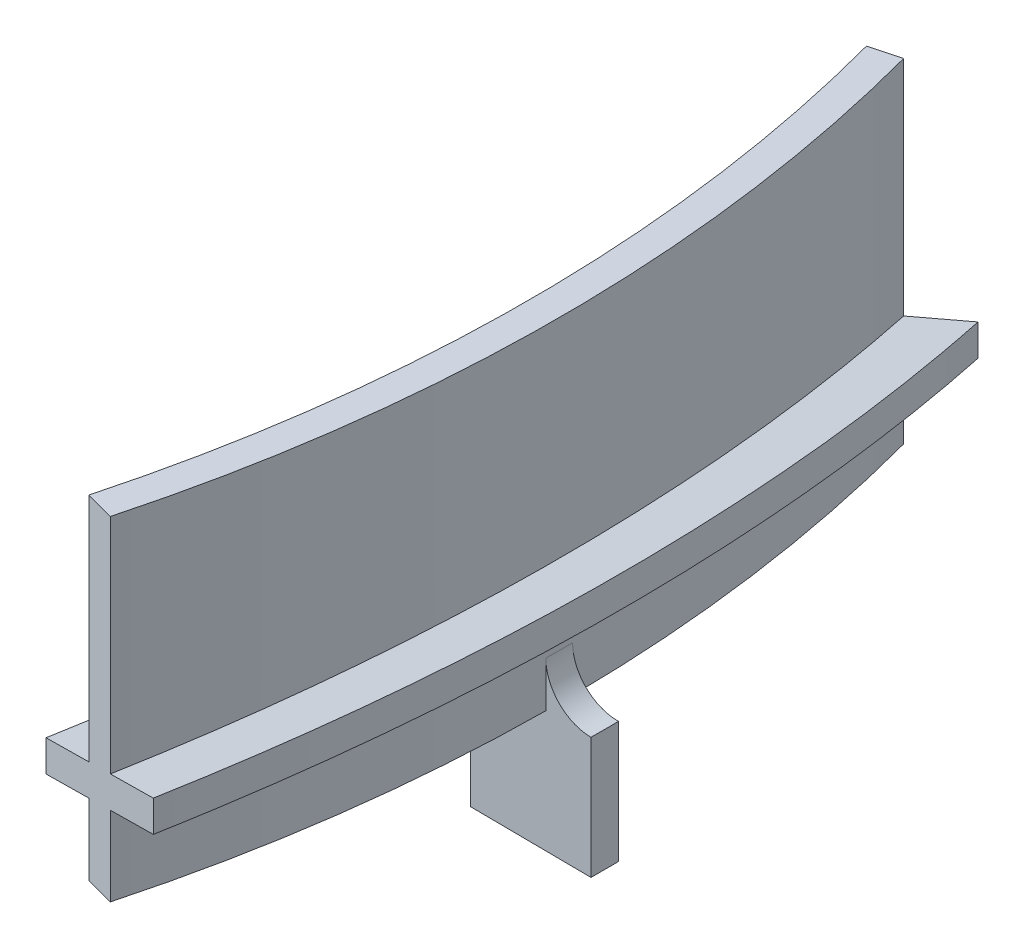
ISO-10303-21;
HEADER;
FILE_DESCRIPTION(('STEP AP214'),'2;1');
FILE_NAME('part.step','',(''),(''),'','','');
FILE_SCHEMA(('AUTOMOTIVE_DESIGN { 1 0 10303 214 1 1 1 1 }'));
ENDSEC;
DATA;
#1=APPLICATION_CONTEXT('core data for automotive mechanical design processes');
#2=APPLICATION_PROTOCOL_DEFINITION('international standard','automotive_design',2000,#1);
#3=PRODUCT_CONTEXT('',#1,'mechanical');
#4=PRODUCT('Part','Part','',(#3));
#5=PRODUCT_RELATED_PRODUCT_CATEGORY('part','',(#4));
#6=PRODUCT_DEFINITION_FORMATION('','',#4);
#7=PRODUCT_DEFINITION_CONTEXT('part definition',#1,'design');
#8=PRODUCT_DEFINITION('design','',#6,#7);
#9=PRODUCT_DEFINITION_SHAPE('','',#8);
#10=(LENGTH_UNIT() NAMED_UNIT(*) SI_UNIT(.MILLI.,.METRE.));
#11=(NAMED_UNIT(*) PLANE_ANGLE_UNIT() SI_UNIT($,.RADIAN.));
#12=(NAMED_UNIT(*) SI_UNIT($,.STERADIAN.) SOLID_ANGLE_UNIT());
#13=UNCERTAINTY_MEASURE_WITH_UNIT(LENGTH_MEASURE(1.E-05),#10,'distance_accuracy_value','');
#14=(GEOMETRIC_REPRESENTATION_CONTEXT(3) GLOBAL_UNCERTAINTY_ASSIGNED_CONTEXT((#13)) GLOBAL_UNIT_ASSIGNED_CONTEXT((#10,
#11,#12)) REPRESENTATION_CONTEXT('',''));
#15=CARTESIAN_POINT('',(0.,0.,0.));
#16=DIRECTION('',(0.,0.,1.));
#17=DIRECTION('',(1.,0.,0.));
#18=AXIS2_PLACEMENT_3D('',#15,#16,#17);
#19=CARTESIAN_POINT('',(97.5585084551959,-5.99999999999999,26.1407235553546));
#20=DIRECTION('',(0.,1.,0.));
#21=DIRECTION('',(0.,0.,1.));
#22=AXIS2_PLACEMENT_3D('',#19,#20,#21);
#23=PLANE('',#22);
#24=DIRECTION('',(-0.999961923064171,0.,-0.00872653549837396));
#25=VECTOR('',#24,1.);
#26=CARTESIAN_POINT('',(95.9963446141604,-5.99999999999998,0.837747407843899));
#27=LINE('',#26,#25);
#28=CARTESIAN_POINT('',(100.996154229481,-5.99999999999998,0.881380085335769));
#29=VERTEX_POINT('',#28);
#30=CARTESIAN_POINT('',(98.996230383353,-5.99999999999998,0.863927014339021));
#31=VERTEX_POINT('',#30);
#32=EDGE_CURVE('E202',#29,#31,#27,.T.);
#33=ORIENTED_EDGE('',*,*,#32,.F.);
#34=CARTESIAN_POINT('',(0.,-5.99999999999998,0.));
#35=DIRECTION('',(0.,1.,0.));
#36=DIRECTION('',(0.,0.,1.));
#37=AXIS2_PLACEMENT_3D('',#34,#35,#36);
#38=CIRCLE('',#37,101.);
#39=CARTESIAN_POINT('',(97.5585084551959,-5.99999999999999,26.1407235553546));
#40=VERTEX_POINT('',#39);
#41=EDGE_CURVE('E288',#40,#29,#38,.T.);
#42=ORIENTED_EDGE('',*,*,#41,.F.);
#43=DIRECTION('',(0.965925826289068,0.,0.258819045102521));
#44=VECTOR('',#43,1.);
#45=CARTESIAN_POINT('',(97.5585084551959,-5.99999999999999,26.1407235553546));
#46=LINE('',#45,#44);
#47=CARTESIAN_POINT('',(95.6266568026177,-5.99999999999999,25.6230854651496));
#48=VERTEX_POINT('',#47);
#49=EDGE_CURVE('E275',#48,#40,#46,.T.);
#50=ORIENTED_EDGE('',*,*,#49,.F.);
#51=CARTESIAN_POINT('',(0.,-5.99999999999998,0.));
#52=DIRECTION('',(0.,1.,0.));
#53=DIRECTION('',(0.,0.,1.));
#54=AXIS2_PLACEMENT_3D('',#51,#52,#53);
#55=CIRCLE('',#54,99.);
#56=EDGE_CURVE('E284',#48,#31,#55,.T.);
#57=ORIENTED_EDGE('',*,*,#56,.T.);
#58=EDGE_LOOP('',(#33,#42,#50,#57));
#59=FACE_BOUND('',#58,.T.);
#60=ADVANCED_FACE('F33',(#59),#23,.F.);
#61=CARTESIAN_POINT('',(0.,0.,0.));
#62=DIRECTION('',(0.258819045102521,0.,-0.965925826289068));
#63=DIRECTION('',(-0.965925826289068,0.,-0.258819045102521));
#64=AXIS2_PLACEMENT_3D('',#61,#62,#63);
#65=PLANE('',#64);
#66=DIRECTION('',(-0.933012701892218,-0.258819045102525,-0.25));
#67=VECTOR('',#66,1.);
#68=CARTESIAN_POINT('',(77.9323285910625,-4.14110472164041,20.8819045102521));
#69=LINE('',#68,#67);
#70=CARTESIAN_POINT('',(95.6266568026177,0.767326987978946,25.6230854651496));
#71=VERTEX_POINT('',#70);
#72=CARTESIAN_POINT('',(91.7629534974615,-0.304469781745555,24.5878092847395));
#73=VERTEX_POINT('',#72);
#74=EDGE_CURVE('E237',#71,#73,#69,.T.);
#75=ORIENTED_EDGE('',*,*,#74,.T.);
#76=DIRECTION('',(0.,1.,0.));
#77=VECTOR('',#76,1.);
#78=CARTESIAN_POINT('',(91.7629534974615,-6.21165708246058,24.5878092847395));
#79=LINE('',#78,#77);
#80=CARTESIAN_POINT('',(91.7629534974615,-2.37502214256572,24.5878092847395));
#81=VERTEX_POINT('',#80);
#82=EDGE_CURVE('E216',#81,#73,#79,.T.);
#83=ORIENTED_EDGE('',*,*,#82,.F.);
#84=DIRECTION('',(0.933012701892218,0.258819045102525,0.25));
#85=VECTOR('',#84,1.);
#86=CARTESIAN_POINT('',(115.252836666751,4.14110472164041,30.8819045102521));
#87=LINE('',#86,#85);
#88=CARTESIAN_POINT('',(95.6266568026177,-1.30322537284122,25.6230854651496));
#89=VERTEX_POINT('',#88);
#90=EDGE_CURVE('E235',#81,#89,#87,.T.);
#91=ORIENTED_EDGE('',*,*,#90,.T.);
#92=DIRECTION('',(0.,-1.,0.));
#93=VECTOR('',#92,1.);
#94=CARTESIAN_POINT('',(95.6266568026177,16.,25.6230854651496));
#95=LINE('',#94,#93);
#96=EDGE_CURVE('E271',#89,#48,#95,.T.);
#97=ORIENTED_EDGE('',*,*,#96,.T.);
#98=ORIENTED_EDGE('',*,*,#49,.T.);
#99=DIRECTION('',(0.,1.,0.));
#100=VECTOR('',#99,1.);
#101=CARTESIAN_POINT('',(97.5585084551959,16.,26.1407235553546));
#102=LINE('',#101,#100);
#103=CARTESIAN_POINT('',(97.5585084551959,-0.767326987978966,26.1407235553546));
#104=VERTEX_POINT('',#103);
#105=EDGE_CURVE('E265',#40,#104,#102,.T.);
#106=ORIENTED_EDGE('',*,*,#105,.T.);
#107=CARTESIAN_POINT('',(101.422211760352,0.304469781745548,27.1759997357647));
#108=VERTEX_POINT('',#107);
#109=EDGE_CURVE('E234',#104,#108,#87,.T.);
#110=ORIENTED_EDGE('',*,*,#109,.T.);
#111=DIRECTION('',(0.,1.,0.));
#112=VECTOR('',#111,1.);
#113=CARTESIAN_POINT('',(101.422211760352,-6.21165708246058,27.1759997357647));
#114=LINE('',#113,#112);
#115=CARTESIAN_POINT('',(101.422211760352,2.37502214256572,27.1759997357647));
#116=VERTEX_POINT('',#115);
#117=EDGE_CURVE('E219',#108,#116,#114,.T.);
#118=ORIENTED_EDGE('',*,*,#117,.T.);
#119=CARTESIAN_POINT('',(97.5585084551959,1.3032253728412,26.1407235553546));
#120=VERTEX_POINT('',#119);
#121=EDGE_CURVE('E238',#116,#120,#69,.T.);
#122=ORIENTED_EDGE('',*,*,#121,.T.);
#123=CARTESIAN_POINT('',(97.5585084551959,16.,26.1407235553546));
#124=VERTEX_POINT('',#123);
#125=EDGE_CURVE('E264',#120,#124,#102,.T.);
#126=ORIENTED_EDGE('',*,*,#125,.T.);
#127=DIRECTION('',(-0.965925826289068,0.,-0.258819045102521));
#128=VECTOR('',#127,1.);
#129=CARTESIAN_POINT('',(97.5585084551959,16.,26.1407235553546));
#130=LINE('',#129,#128);
#131=CARTESIAN_POINT('',(95.6266568026177,16.,25.6230854651496));
#132=VERTEX_POINT('',#131);
#133=EDGE_CURVE('E268',#124,#132,#130,.T.);
#134=ORIENTED_EDGE('',*,*,#133,.T.);
#135=EDGE_CURVE('E272',#132,#71,#95,.T.);
#136=ORIENTED_EDGE('',*,*,#135,.T.);
#137=EDGE_LOOP('',(#75,#83,#91,#97,#98,#106,#110,#118,#122,#126,#134,#136));
#138=FACE_BOUND('',#137,.T.);
#139=ADVANCED_FACE('F340',(#138),#65,.F.);
#140=CARTESIAN_POINT('',(77.9323285910625,-4.14110472164041,-36.1180954897479));
#141=DIRECTION('',(-0.267307160363569,0.963611374994279,0.));
#142=DIRECTION('',(-0.963611374994279,-0.267307160363569,0.));
#143=AXIS2_PLACEMENT_3D('',#140,#141,#142);
#144=PLANE('',#143);
#145=ORIENTED_EDGE('',*,*,#121,.F.);
#146=CARTESIAN_POINT('',(0.,-25.7596430627026,0.));
#147=DIRECTION('',(-0.267307160363569,0.963611374994279,0.));
#148=DIRECTION('',(0.963611374994279,0.267307160363569,0.));
#149=AXIS2_PLACEMENT_3D('',#146,#147,#148);
#150=ELLIPSE('',#149,108.965089791124,105.);
#151=CARTESIAN_POINT('',(101.422211760352,2.37502214256572,-27.1759997357647));
#152=VERTEX_POINT('',#151);
#153=EDGE_CURVE('E229',#116,#152,#150,.T.);
#154=ORIENTED_EDGE('',*,*,#153,.T.);
#155=DIRECTION('',(0.933012701892218,0.258819045102525,-0.25));
#156=VECTOR('',#155,1.);
#157=CARTESIAN_POINT('',(81.4862185191438,-3.15525062156221,-21.8341664464706));
#158=LINE('',#157,#156);
#159=CARTESIAN_POINT('',(97.5585084551959,1.30322537284121,-26.1407235553546));
#160=VERTEX_POINT('',#159);
#161=EDGE_CURVE('E218',#160,#152,#158,.T.);
#162=ORIENTED_EDGE('',*,*,#161,.F.);
#163=CARTESIAN_POINT('',(0.,-25.7596430627026,0.));
#164=DIRECTION('',(-0.267307160363569,0.963611374994279,0.));
#165=DIRECTION('',(0.963611374994279,0.267307160363569,0.));
#166=AXIS2_PLACEMENT_3D('',#163,#164,#165);
#167=ELLIPSE('',#166,104.814038751462,101.);
#168=EDGE_CURVE('E247',#120,#160,#167,.T.);
#169=ORIENTED_EDGE('',*,*,#168,.F.);
#170=EDGE_LOOP('',(#145,#154,#162,#169));
#171=FACE_BOUND('',#170,.T.);
#172=ADVANCED_FACE('F345',(#171),#144,.T.);
#173=CARTESIAN_POINT('',(115.252836666751,4.14110472164041,-26.1180954897479));
#174=DIRECTION('',(0.267307160363569,-0.963611374994279,0.));
#175=DIRECTION('',(0.963611374994279,0.267307160363569,0.));
#176=AXIS2_PLACEMENT_3D('',#173,#174,#175);
#177=PLANE('',#176);
#178=DIRECTION('',(-0.933012701892218,-0.258819045102525,0.25));
#179=VECTOR('',#178,1.);
#180=CARTESIAN_POINT('',(114.141663085371,3.83286359620598,-30.5841664464706));
#181=LINE('',#180,#179);
#182=CARTESIAN_POINT('',(101.422211760352,0.304469781745549,-27.1759997357647));
#183=VERTEX_POINT('',#182);
#184=CARTESIAN_POINT('',(97.5585084551959,-0.767326987978964,-26.1407235553546));
#185=VERTEX_POINT('',#184);
#186=EDGE_CURVE('E293',#183,#185,#181,.T.);
#187=ORIENTED_EDGE('',*,*,#186,.F.);
#188=CARTESIAN_POINT('',(0.,-27.8301954235228,0.));
#189=DIRECTION('',(0.267307160363569,-0.963611374994279,0.));
#190=DIRECTION('',(0.963611374994279,0.267307160363569,0.));
#191=AXIS2_PLACEMENT_3D('',#188,#189,#190);
#192=ELLIPSE('',#191,108.965089791124,105.);
#193=EDGE_CURVE('E203',#183,#108,#192,.T.);
#194=ORIENTED_EDGE('',*,*,#193,.T.);
#195=ORIENTED_EDGE('',*,*,#109,.F.);
#196=CARTESIAN_POINT('',(0.,-27.8301954235228,0.));
#197=DIRECTION('',(0.267307160363569,-0.963611374994279,0.));
#198=DIRECTION('',(0.963611374994279,0.267307160363569,0.));
#199=AXIS2_PLACEMENT_3D('',#196,#197,#198);
#200=ELLIPSE('',#199,104.814038751462,101.);
#201=EDGE_CURVE('E243',#185,#104,#200,.T.);
#202=ORIENTED_EDGE('',*,*,#201,.F.);
#203=EDGE_LOOP('',(#187,#194,#195,#202));
#204=FACE_BOUND('',#203,.T.);
#205=ADVANCED_FACE('F367',(#204),#177,.T.);
#206=CARTESIAN_POINT('',(0.,12.85,0.));
#207=DIRECTION('',(0.,1.,0.));
#208=DIRECTION('',(0.,0.,1.));
#209=AXIS2_PLACEMENT_3D('',#206,#207,#208);
#210=CYLINDRICAL_SURFACE('',#209,101.);
#211=ORIENTED_EDGE('',*,*,#125,.F.);
#212=ORIENTED_EDGE('',*,*,#168,.T.);
#213=DIRECTION('',(0.,1.,0.));
#214=VECTOR('',#213,1.);
#215=CARTESIAN_POINT('',(97.5585084551959,16.,-26.1407235553547));
#216=LINE('',#215,#214);
#217=CARTESIAN_POINT('',(97.5585084551959,16.,-26.1407235553547));
#218=VERTEX_POINT('',#217);
#219=EDGE_CURVE('E250',#160,#218,#216,.T.);
#220=ORIENTED_EDGE('',*,*,#219,.T.);
#221=CARTESIAN_POINT('',(0.,16.,0.));
#222=DIRECTION('',(0.,1.,0.));
#223=DIRECTION('',(0.,0.,1.));
#224=AXIS2_PLACEMENT_3D('',#221,#222,#223);
#225=CIRCLE('',#224,101.);
#226=EDGE_CURVE('E278',#124,#218,#225,.T.);
#227=ORIENTED_EDGE('',*,*,#226,.F.);
#228=EDGE_LOOP('',(#211,#212,#220,#227));
#229=FACE_BOUND('',#228,.T.);
#230=ADVANCED_FACE('F358',(#229),#210,.T.);
#231=CARTESIAN_POINT('',(0.,12.85,0.));
#232=DIRECTION('',(0.,1.,0.));
#233=DIRECTION('',(0.,0.,1.));
#234=AXIS2_PLACEMENT_3D('',#231,#232,#233);
#235=CYLINDRICAL_SURFACE('',#234,99.);
#236=DIRECTION('',(0.,-1.,0.));
#237=VECTOR('',#236,1.);
#238=CARTESIAN_POINT('',(95.6266568026177,16.,-25.6230854651496));
#239=LINE('',#238,#237);
#240=CARTESIAN_POINT('',(95.6266568026177,16.,-25.6230854651496));
#241=VERTEX_POINT('',#240);
#242=CARTESIAN_POINT('',(95.6266568026177,0.767326987978951,-25.6230854651496));
#243=VERTEX_POINT('',#242);
#244=EDGE_CURVE('E258',#241,#243,#239,.T.);
#245=ORIENTED_EDGE('',*,*,#244,.T.);
#246=CARTESIAN_POINT('',(0.,-25.7596430627026,0.));
#247=DIRECTION('',(-0.267307160363569,0.963611374994279,0.));
#248=DIRECTION('',(0.963611374994279,0.267307160363569,0.));
#249=AXIS2_PLACEMENT_3D('',#246,#247,#248);
#250=ELLIPSE('',#249,102.738513231631,99.);
#251=EDGE_CURVE('E245',#243,#71,#250,.F.);
#252=ORIENTED_EDGE('',*,*,#251,.T.);
#253=ORIENTED_EDGE('',*,*,#135,.F.);
#254=CARTESIAN_POINT('',(0.,16.,0.));
#255=DIRECTION('',(0.,1.,0.));
#256=DIRECTION('',(0.,0.,1.));
#257=AXIS2_PLACEMENT_3D('',#254,#255,#256);
#258=CIRCLE('',#257,99.);
#259=EDGE_CURVE('E281',#132,#241,#258,.T.);
#260=ORIENTED_EDGE('',*,*,#259,.T.);
#261=EDGE_LOOP('',(#245,#252,#253,#260));
#262=FACE_BOUND('',#261,.T.);
#263=ADVANCED_FACE('F356',(#262),#235,.F.);
#264=CARTESIAN_POINT('',(0.,-2.99999999999999,0.));
#265=DIRECTION('',(0.,-1.,0.));
#266=DIRECTION('',(0.,0.,-1.));
#267=AXIS2_PLACEMENT_3D('',#264,#265,#266);
#268=CIRCLE('',#267,101.);
#269=CARTESIAN_POINT('',(100.996154229481,-2.99999999999999,0.88138008533577));
#270=VERTEX_POINT('',#269);
#271=CARTESIAN_POINT('',(100.996154229481,-2.99999999999999,-0.881380085335769));
#272=VERTEX_POINT('',#271);
#273=EDGE_CURVE('E303',#270,#272,#268,.F.);
#274=ORIENTED_EDGE('',*,*,#273,.T.);
#275=DIRECTION('',(0.,1.,0.));
#276=VECTOR('',#275,1.);
#277=CARTESIAN_POINT('',(100.996154229481,-2.99999999999999,-0.881380085335769));
#278=LINE('',#277,#276);
#279=CARTESIAN_POINT('',(100.996154229481,-5.99999999999998,-0.88138008533577));
#280=VERTEX_POINT('',#279);
#281=EDGE_CURVE('E306',#272,#280,#278,.F.);
#282=ORIENTED_EDGE('',*,*,#281,.T.);
#283=CARTESIAN_POINT('',(97.5585084551959,-5.99999999999999,-26.1407235553547));
#284=VERTEX_POINT('',#283);
#285=EDGE_CURVE('E287',#280,#284,#38,.T.);
#286=ORIENTED_EDGE('',*,*,#285,.T.);
#287=EDGE_CURVE('E251',#284,#185,#216,.T.);
#288=ORIENTED_EDGE('',*,*,#287,.T.);
#289=ORIENTED_EDGE('',*,*,#201,.T.);
#290=ORIENTED_EDGE('',*,*,#105,.F.);
#291=ORIENTED_EDGE('',*,*,#41,.T.);
#292=DIRECTION('',(0.,1.,0.));
#293=VECTOR('',#292,1.);
#294=CARTESIAN_POINT('',(100.996154229481,-5.99999999999998,0.881380085335769));
#295=LINE('',#294,#293);
#296=EDGE_CURVE('E47',#29,#270,#295,.T.);
#297=ORIENTED_EDGE('',*,*,#296,.T.);
#298=EDGE_LOOP('',(#274,#282,#286,#288,#289,#290,#291,#297));
#299=FACE_BOUND('',#298,.T.);
#300=ADVANCED_FACE('F320',(#299),#210,.T.);
#301=ORIENTED_EDGE('',*,*,#285,.F.);
#302=DIRECTION('',(-0.999961923064171,0.,0.00872653549837395));
#303=VECTOR('',#302,1.);
#304=CARTESIAN_POINT('',(95.9963446141604,-5.99999999999998,-0.8377474078439));
#305=LINE('',#304,#303);
#306=CARTESIAN_POINT('',(98.996230383353,-5.99999999999998,-0.863927014339021));
#307=VERTEX_POINT('',#306);
#308=EDGE_CURVE('E199',#280,#307,#305,.T.);
#309=ORIENTED_EDGE('',*,*,#308,.T.);
#310=CARTESIAN_POINT('',(95.6266568026177,-5.99999999999999,-25.6230854651496));
#311=VERTEX_POINT('',#310);
#312=EDGE_CURVE('E283',#307,#311,#55,.T.);
#313=ORIENTED_EDGE('',*,*,#312,.T.);
#314=DIRECTION('',(0.965925826289068,0.,-0.258819045102521));
#315=VECTOR('',#314,1.);
#316=CARTESIAN_POINT('',(97.5585084551959,-5.99999999999999,-26.1407235553547));
#317=LINE('',#316,#315);
#318=EDGE_CURVE('E261',#311,#284,#317,.T.);
#319=ORIENTED_EDGE('',*,*,#318,.T.);
#320=EDGE_LOOP('',(#301,#309,#313,#319));
#321=FACE_BOUND('',#320,.T.);
#322=ADVANCED_FACE('F341',(#321),#23,.F.);
#323=ORIENTED_EDGE('',*,*,#312,.F.);
#324=DIRECTION('',(0.,1.,0.));
#325=VECTOR('',#324,1.);
#326=CARTESIAN_POINT('',(98.996230383353,-5.99999999999998,-0.863927014339021));
#327=LINE('',#326,#325);
#328=CARTESIAN_POINT('',(98.996230383353,-2.99999999999999,-0.863927014339021));
#329=VERTEX_POINT('',#328);
#330=EDGE_CURVE('E55',#307,#329,#327,.T.);
#331=ORIENTED_EDGE('',*,*,#330,.T.);
#332=CARTESIAN_POINT('',(0.,-2.99999999999999,0.));
#333=DIRECTION('',(0.,-1.,0.));
#334=DIRECTION('',(0.,0.,-1.));
#335=AXIS2_PLACEMENT_3D('',#332,#333,#334);
#336=CIRCLE('',#335,99.);
#337=CARTESIAN_POINT('',(98.996230383353,-2.99999999999999,0.863927014339022));
#338=VERTEX_POINT('',#337);
#339=EDGE_CURVE('E298',#329,#338,#336,.T.);
#340=ORIENTED_EDGE('',*,*,#339,.T.);
#341=DIRECTION('',(0.,1.,0.));
#342=VECTOR('',#341,1.);
#343=CARTESIAN_POINT('',(98.996230383353,-2.99999999999999,0.863927014339022));
#344=LINE('',#343,#342);
#345=EDGE_CURVE('E210',#338,#31,#344,.F.);
#346=ORIENTED_EDGE('',*,*,#345,.T.);
#347=ORIENTED_EDGE('',*,*,#56,.F.);
#348=ORIENTED_EDGE('',*,*,#96,.F.);
#349=CARTESIAN_POINT('',(0.,-27.8301954235228,0.));
#350=DIRECTION('',(0.267307160363569,-0.963611374994279,0.));
#351=DIRECTION('',(0.963611374994279,0.267307160363569,0.));
#352=AXIS2_PLACEMENT_3D('',#349,#350,#351);
#353=ELLIPSE('',#352,102.738513231631,99.);
#354=CARTESIAN_POINT('',(95.6266568026177,-1.30322537284121,-25.6230854651496));
#355=VERTEX_POINT('',#354);
#356=EDGE_CURVE('E240',#89,#355,#353,.F.);
#357=ORIENTED_EDGE('',*,*,#356,.T.);
#358=EDGE_CURVE('E257',#355,#311,#239,.T.);
#359=ORIENTED_EDGE('',*,*,#358,.T.);
#360=EDGE_LOOP('',(#323,#331,#340,#346,#347,#348,#357,#359));
#361=FACE_BOUND('',#360,.T.);
#362=ADVANCED_FACE('F329',(#361),#235,.F.);
#363=CARTESIAN_POINT('',(97.5585084551959,16.,26.1407235553546));
#364=DIRECTION('',(0.,-1.,0.));
#365=DIRECTION('',(0.,0.,-1.));
#366=AXIS2_PLACEMENT_3D('',#363,#364,#365);
#367=PLANE('',#366);
#368=ORIENTED_EDGE('',*,*,#133,.F.);
#369=ORIENTED_EDGE('',*,*,#226,.T.);
#370=DIRECTION('',(-0.965925826289068,0.,0.258819045102521));
#371=VECTOR('',#370,1.);
#372=CARTESIAN_POINT('',(97.5585084551959,16.,-26.1407235553547));
#373=LINE('',#372,#371);
#374=EDGE_CURVE('E254',#218,#241,#373,.T.);
#375=ORIENTED_EDGE('',*,*,#374,.T.);
#376=ORIENTED_EDGE('',*,*,#259,.F.);
#377=EDGE_LOOP('',(#368,#369,#375,#376));
#378=FACE_BOUND('',#377,.T.);
#379=ADVANCED_FACE('F355',(#378),#367,.F.);
#380=CARTESIAN_POINT('',(0.,0.,0.));
#381=DIRECTION('',(-0.258819045102521,0.,-0.965925826289068));
#382=DIRECTION('',(-0.965925826289068,0.,0.258819045102521));
#383=AXIS2_PLACEMENT_3D('',#380,#381,#382);
#384=PLANE('',#383);
#385=ORIENTED_EDGE('',*,*,#358,.F.);
#386=CARTESIAN_POINT('',(91.7629534974615,-2.37502214256572,-24.5878092847395));
#387=VERTEX_POINT('',#386);
#388=EDGE_CURVE('E290',#355,#387,#181,.T.);
#389=ORIENTED_EDGE('',*,*,#388,.T.);
#390=DIRECTION('',(0.,1.,0.));
#391=VECTOR('',#390,1.);
#392=CARTESIAN_POINT('',(91.7629534974615,-6.21165708246058,-24.5878092847395));
#393=LINE('',#392,#391);
#394=CARTESIAN_POINT('',(91.7629534974615,-0.304469781745554,-24.5878092847395));
#395=VERTEX_POINT('',#394);
#396=EDGE_CURVE('E182',#387,#395,#393,.T.);
#397=ORIENTED_EDGE('',*,*,#396,.T.);
#398=EDGE_CURVE('E228',#395,#243,#158,.T.);
#399=ORIENTED_EDGE('',*,*,#398,.T.);
#400=ORIENTED_EDGE('',*,*,#244,.F.);
#401=ORIENTED_EDGE('',*,*,#374,.F.);
#402=ORIENTED_EDGE('',*,*,#219,.F.);
#403=ORIENTED_EDGE('',*,*,#161,.T.);
#404=DIRECTION('',(0.,1.,0.));
#405=VECTOR('',#404,1.);
#406=CARTESIAN_POINT('',(101.422211760352,-6.21165708246058,-27.1759997357647));
#407=LINE('',#406,#405);
#408=EDGE_CURVE('E222',#183,#152,#407,.T.);
#409=ORIENTED_EDGE('',*,*,#408,.F.);
#410=ORIENTED_EDGE('',*,*,#186,.T.);
#411=ORIENTED_EDGE('',*,*,#287,.F.);
#412=ORIENTED_EDGE('',*,*,#318,.F.);
#413=EDGE_LOOP('',(#385,#389,#397,#399,#400,#401,#402,#403,#409,#410,#411,#412));
#414=FACE_BOUND('',#413,.T.);
#415=ADVANCED_FACE('F381',(#414),#384,.T.);
#416=CARTESIAN_POINT('',(0.,-25.7596430627026,0.));
#417=DIRECTION('',(-0.267307160363569,0.963611374994279,0.));
#418=DIRECTION('',(0.963611374994279,0.267307160363569,0.));
#419=AXIS2_PLACEMENT_3D('',#416,#417,#418);
#420=ELLIPSE('',#419,98.5874621919693,95.);
#421=EDGE_CURVE('E232',#73,#395,#420,.T.);
#422=ORIENTED_EDGE('',*,*,#421,.F.);
#423=ORIENTED_EDGE('',*,*,#74,.F.);
#424=ORIENTED_EDGE('',*,*,#251,.F.);
#425=ORIENTED_EDGE('',*,*,#398,.F.);
#426=EDGE_LOOP('',(#422,#423,#424,#425));
#427=FACE_BOUND('',#426,.T.);
#428=ADVANCED_FACE('F383',(#427),#144,.T.);
#429=CARTESIAN_POINT('',(0.,-27.8301954235228,0.));
#430=DIRECTION('',(0.267307160363569,-0.963611374994279,0.));
#431=DIRECTION('',(0.963611374994279,0.267307160363569,0.));
#432=AXIS2_PLACEMENT_3D('',#429,#430,#431);
#433=ELLIPSE('',#432,98.5874621919693,95.);
#434=EDGE_CURVE('E292',#387,#81,#433,.T.);
#435=ORIENTED_EDGE('',*,*,#434,.F.);
#436=ORIENTED_EDGE('',*,*,#388,.F.);
#437=ORIENTED_EDGE('',*,*,#356,.F.);
#438=ORIENTED_EDGE('',*,*,#90,.F.);
#439=EDGE_LOOP('',(#435,#436,#437,#438));
#440=FACE_BOUND('',#439,.T.);
#441=ADVANCED_FACE('F378',(#440),#177,.T.);
#442=CARTESIAN_POINT('',(0.,-6.21165708246058,0.));
#443=DIRECTION('',(0.,1.,0.));
#444=DIRECTION('',(0.,0.,1.));
#445=AXIS2_PLACEMENT_3D('',#442,#443,#444);
#446=CYLINDRICAL_SURFACE('',#445,95.);
#447=ORIENTED_EDGE('',*,*,#421,.T.);
#448=ORIENTED_EDGE('',*,*,#396,.F.);
#449=ORIENTED_EDGE('',*,*,#434,.T.);
#450=ORIENTED_EDGE('',*,*,#82,.T.);
#451=EDGE_LOOP('',(#447,#448,#449,#450));
#452=FACE_BOUND('',#451,.T.);
#453=ADVANCED_FACE('F395',(#452),#446,.F.);
#454=CARTESIAN_POINT('',(0.,-6.21165708246058,0.));
#455=DIRECTION('',(0.,1.,0.));
#456=DIRECTION('',(0.,0.,1.));
#457=AXIS2_PLACEMENT_3D('',#454,#455,#456);
#458=CYLINDRICAL_SURFACE('',#457,105.);
#459=ORIENTED_EDGE('',*,*,#117,.F.);
#460=ORIENTED_EDGE('',*,*,#193,.F.);
#461=ORIENTED_EDGE('',*,*,#408,.T.);
#462=ORIENTED_EDGE('',*,*,#153,.F.);
#463=EDGE_LOOP('',(#459,#460,#461,#462));
#464=FACE_BOUND('',#463,.T.);
#465=ADVANCED_FACE('F399',(#464),#458,.T.);
#466=CARTESIAN_POINT('',(0.,12.85,0.));
#467=DIRECTION('',(0.,1.,0.));
#468=DIRECTION('',(0.,0.,1.));
#469=AXIS2_PLACEMENT_3D('',#466,#467,#468);
#470=CYLINDRICAL_SURFACE('',#469,96.);
#471=CARTESIAN_POINT('',(0.,-14.,0.));
#472=DIRECTION('',(0.,1.,0.));
#473=DIRECTION('',(0.,0.,1.));
#474=AXIS2_PLACEMENT_3D('',#471,#472,#473);
#475=CIRCLE('',#474,96.);
#476=CARTESIAN_POINT('',(95.9963446141604,-14.,0.837747407843899));
#477=VERTEX_POINT('',#476);
#478=CARTESIAN_POINT('',(95.9963446141604,-14.,-0.8377474078439));
#479=VERTEX_POINT('',#478);
#480=EDGE_CURVE('E171',#477,#479,#475,.T.);
#481=ORIENTED_EDGE('',*,*,#480,.F.);
#482=DIRECTION('',(0.,-1.,0.));
#483=VECTOR('',#482,1.);
#484=CARTESIAN_POINT('',(95.9963446141604,-5.99999999999998,0.837747407843899));
#485=LINE('',#484,#483);
#486=CARTESIAN_POINT('',(95.9963446141604,-5.99999999999998,0.837747407843899));
#487=VERTEX_POINT('',#486);
#488=EDGE_CURVE('E196',#487,#477,#485,.T.);
#489=ORIENTED_EDGE('',*,*,#488,.F.);
#490=CARTESIAN_POINT('',(0.,-5.99999999999998,0.));
#491=DIRECTION('',(0.,1.,0.));
#492=DIRECTION('',(0.,0.,1.));
#493=AXIS2_PLACEMENT_3D('',#490,#491,#492);
#494=CIRCLE('',#493,96.);
#495=CARTESIAN_POINT('',(95.9963446141604,-5.99999999999998,-0.8377474078439));
#496=VERTEX_POINT('',#495);
#497=EDGE_CURVE('E190',#487,#496,#494,.T.);
#498=ORIENTED_EDGE('',*,*,#497,.T.);
#499=DIRECTION('',(0.,-1.,0.));
#500=VECTOR('',#499,1.);
#501=CARTESIAN_POINT('',(95.9963446141604,-5.99999999999998,-0.8377474078439));
#502=LINE('',#501,#500);
#503=EDGE_CURVE('E187',#496,#479,#502,.T.);
#504=ORIENTED_EDGE('',*,*,#503,.T.);
#505=EDGE_LOOP('',(#481,#489,#498,#504));
#506=FACE_BOUND('',#505,.T.);
#507=ADVANCED_FACE('F188',(#506),#470,.F.);
#508=CARTESIAN_POINT('',(95.9963446141604,-14.,0.837747407843899));
#509=DIRECTION('',(0.,1.,0.));
#510=DIRECTION('',(0.,0.,1.));
#511=AXIS2_PLACEMENT_3D('',#508,#509,#510);
#512=PLANE('',#511);
#513=CARTESIAN_POINT('',(0.,-14.,0.));
#514=DIRECTION('',(0.,1.,0.));
#515=DIRECTION('',(0.,0.,1.));
#516=AXIS2_PLACEMENT_3D('',#513,#514,#515);
#517=CIRCLE('',#516,104.);
#518=CARTESIAN_POINT('',(103.996039998674,-14.,0.907559691830891));
#519=VERTEX_POINT('',#518);
#520=CARTESIAN_POINT('',(103.996039998674,-14.,-0.907559691830891));
#521=VERTEX_POINT('',#520);
#522=EDGE_CURVE('E183',#519,#521,#517,.T.);
#523=ORIENTED_EDGE('',*,*,#522,.F.);
#524=DIRECTION('',(0.999961923064171,0.,0.00872653549837396));
#525=VECTOR('',#524,1.);
#526=CARTESIAN_POINT('',(95.9963446141604,-14.,0.837747407843899));
#527=LINE('',#526,#525);
#528=EDGE_CURVE('E178',#477,#519,#527,.T.);
#529=ORIENTED_EDGE('',*,*,#528,.F.);
#530=ORIENTED_EDGE('',*,*,#480,.T.);
#531=DIRECTION('',(0.999961923064171,0.,-0.00872653549837395));
#532=VECTOR('',#531,1.);
#533=CARTESIAN_POINT('',(95.9963446141604,-14.,-0.8377474078439));
#534=LINE('',#533,#532);
#535=EDGE_CURVE('E175',#479,#521,#534,.T.);
#536=ORIENTED_EDGE('',*,*,#535,.T.);
#537=EDGE_LOOP('',(#523,#529,#530,#536));
#538=FACE_BOUND('',#537,.T.);
#539=ADVANCED_FACE('F173',(#538),#512,.F.);
#540=CARTESIAN_POINT('',(0.,12.85,0.));
#541=DIRECTION('',(0.,1.,0.));
#542=DIRECTION('',(0.,0.,1.));
#543=AXIS2_PLACEMENT_3D('',#540,#541,#542);
#544=CYLINDRICAL_SURFACE('',#543,104.);
#545=CARTESIAN_POINT('',(0.,-5.99999999999998,0.));
#546=DIRECTION('',(0.,1.,0.));
#547=DIRECTION('',(0.,0.,1.));
#548=AXIS2_PLACEMENT_3D('',#545,#546,#547);
#549=CIRCLE('',#548,104.);
#550=CARTESIAN_POINT('',(103.996039998674,-5.99999999999998,0.907559691830891));
#551=VERTEX_POINT('',#550);
#552=CARTESIAN_POINT('',(103.996039998674,-5.99999999999998,-0.907559691830891));
#553=VERTEX_POINT('',#552);
#554=EDGE_CURVE('E212',#551,#553,#549,.T.);
#555=ORIENTED_EDGE('',*,*,#554,.F.);
#556=DIRECTION('',(0.,1.,0.));
#557=VECTOR('',#556,1.);
#558=CARTESIAN_POINT('',(103.996039998674,-5.99999999999998,0.907559691830891));
#559=LINE('',#558,#557);
#560=EDGE_CURVE('E206',#519,#551,#559,.T.);
#561=ORIENTED_EDGE('',*,*,#560,.F.);
#562=ORIENTED_EDGE('',*,*,#522,.T.);
#563=DIRECTION('',(0.,1.,0.));
#564=VECTOR('',#563,1.);
#565=CARTESIAN_POINT('',(103.996039998674,-5.99999999999998,-0.907559691830891));
#566=LINE('',#565,#564);
#567=EDGE_CURVE('E194',#521,#553,#566,.T.);
#568=ORIENTED_EDGE('',*,*,#567,.T.);
#569=EDGE_LOOP('',(#555,#561,#562,#568));
#570=FACE_BOUND('',#569,.T.);
#571=ADVANCED_FACE('F315',(#570),#544,.T.);
#572=CARTESIAN_POINT('',(0.,0.,0.));
#573=DIRECTION('',(-0.00872653549837396,0.,0.999961923064171));
#574=DIRECTION('',(0.999961923064171,0.,0.00872653549837396));
#575=AXIS2_PLACEMENT_3D('',#572,#573,#574);
#576=PLANE('',#575);
#577=ORIENTED_EDGE('',*,*,#488,.T.);
#578=ORIENTED_EDGE('',*,*,#528,.T.);
#579=ORIENTED_EDGE('',*,*,#560,.T.);
#580=CARTESIAN_POINT('',(103.996039998674,-2.99999999999999,0.907559691830891));
#581=DIRECTION('',(-0.00872653549837396,0.,0.999961923064171));
#582=DIRECTION('',(0.999961923064171,0.,0.00872653549837396));
#583=AXIS2_PLACEMENT_3D('',#580,#581,#582);
#584=CIRCLE('',#583,3.);
#585=EDGE_CURVE('E11',#551,#270,#584,.F.);
#586=ORIENTED_EDGE('',*,*,#585,.T.);
#587=ORIENTED_EDGE('',*,*,#296,.F.);
#588=ORIENTED_EDGE('',*,*,#32,.T.);
#589=ORIENTED_EDGE('',*,*,#345,.F.);
#590=CARTESIAN_POINT('',(95.9963446141604,-2.99999999999999,0.8377474078439));
#591=DIRECTION('',(-0.00872653549837396,0.,0.999961923064171));
#592=DIRECTION('',(0.999961923064171,0.,0.00872653549837396));
#593=AXIS2_PLACEMENT_3D('',#590,#591,#592);
#594=CIRCLE('',#593,3.);
#595=EDGE_CURVE('E310',#338,#487,#594,.F.);
#596=ORIENTED_EDGE('',*,*,#595,.T.);
#597=EDGE_LOOP('',(#577,#578,#579,#586,#587,#588,#589,#596));
#598=FACE_BOUND('',#597,.T.);
#599=ADVANCED_FACE('F318',(#598),#576,.T.);
#600=CARTESIAN_POINT('',(0.,0.,0.));
#601=DIRECTION('',(0.00872653549837395,0.,0.999961923064171));
#602=DIRECTION('',(0.999961923064171,0.,-0.00872653549837395));
#603=AXIS2_PLACEMENT_3D('',#600,#601,#602);
#604=PLANE('',#603);
#605=ORIENTED_EDGE('',*,*,#503,.F.);
#606=CARTESIAN_POINT('',(95.9963446141604,-2.99999999999999,-0.8377474078439));
#607=DIRECTION('',(0.00872653549837395,0.,0.999961923064171));
#608=DIRECTION('',(0.999961923064171,0.,-0.00872653549837395));
#609=AXIS2_PLACEMENT_3D('',#606,#607,#608);
#610=CIRCLE('',#609,3.);
#611=EDGE_CURVE('E308',#496,#329,#610,.T.);
#612=ORIENTED_EDGE('',*,*,#611,.T.);
#613=ORIENTED_EDGE('',*,*,#330,.F.);
#614=ORIENTED_EDGE('',*,*,#308,.F.);
#615=ORIENTED_EDGE('',*,*,#281,.F.);
#616=CARTESIAN_POINT('',(103.996039998674,-2.99999999999999,-0.907559691830891));
#617=DIRECTION('',(0.00872653549837395,0.,0.999961923064171));
#618=DIRECTION('',(0.999961923064171,0.,-0.00872653549837395));
#619=AXIS2_PLACEMENT_3D('',#616,#617,#618);
#620=CIRCLE('',#619,3.);
#621=EDGE_CURVE('E41',#272,#553,#620,.T.);
#622=ORIENTED_EDGE('',*,*,#621,.T.);
#623=ORIENTED_EDGE('',*,*,#567,.F.);
#624=ORIENTED_EDGE('',*,*,#535,.F.);
#625=EDGE_LOOP('',(#605,#612,#613,#614,#615,#622,#623,#624));
#626=FACE_BOUND('',#625,.T.);
#627=ADVANCED_FACE('F192',(#626),#604,.F.);
#628=CARTESIAN_POINT('',(0.,-2.99999999999999,0.));
#629=DIRECTION('',(0.,-1.,0.));
#630=DIRECTION('',(0.,0.,-1.));
#631=AXIS2_PLACEMENT_3D('',#628,#629,#630);
#632=TOROIDAL_SURFACE('',#631,96.,3.);
#633=ORIENTED_EDGE('',*,*,#595,.F.);
#634=ORIENTED_EDGE('',*,*,#339,.F.);
#635=ORIENTED_EDGE('',*,*,#611,.F.);
#636=ORIENTED_EDGE('',*,*,#497,.F.);
#637=EDGE_LOOP('',(#633,#634,#635,#636));
#638=FACE_BOUND('',#637,.T.);
#639=ADVANCED_FACE('F331',(#638),#632,.F.);
#640=CARTESIAN_POINT('',(0.,-2.99999999999999,0.));
#641=DIRECTION('',(0.,-1.,0.));
#642=DIRECTION('',(0.,0.,-1.));
#643=AXIS2_PLACEMENT_3D('',#640,#641,#642);
#644=TOROIDAL_SURFACE('',#643,104.,3.);
#645=ORIENTED_EDGE('',*,*,#585,.F.);
#646=ORIENTED_EDGE('',*,*,#554,.T.);
#647=ORIENTED_EDGE('',*,*,#621,.F.);
#648=ORIENTED_EDGE('',*,*,#273,.F.);
#649=EDGE_LOOP('',(#645,#646,#647,#648));
#650=FACE_BOUND('',#649,.T.);
#651=ADVANCED_FACE('F35',(#650),#644,.F.);
#652=CLOSED_SHELL('',(#60,#139,#172,#205,#230,#263,#300,#322,#362,#379,#415,#428,#441,#453,#465,
#507,#539,#571,#599,#627,#639,#651));
#653=MANIFOLD_SOLID_BREP('B2',#652);
#654=ADVANCED_BREP_SHAPE_REPRESENTATION('',(#18,#653),#14);
#655=SHAPE_DEFINITION_REPRESENTATION(#9,#654);
ENDSEC;
END-ISO-10303-21;
